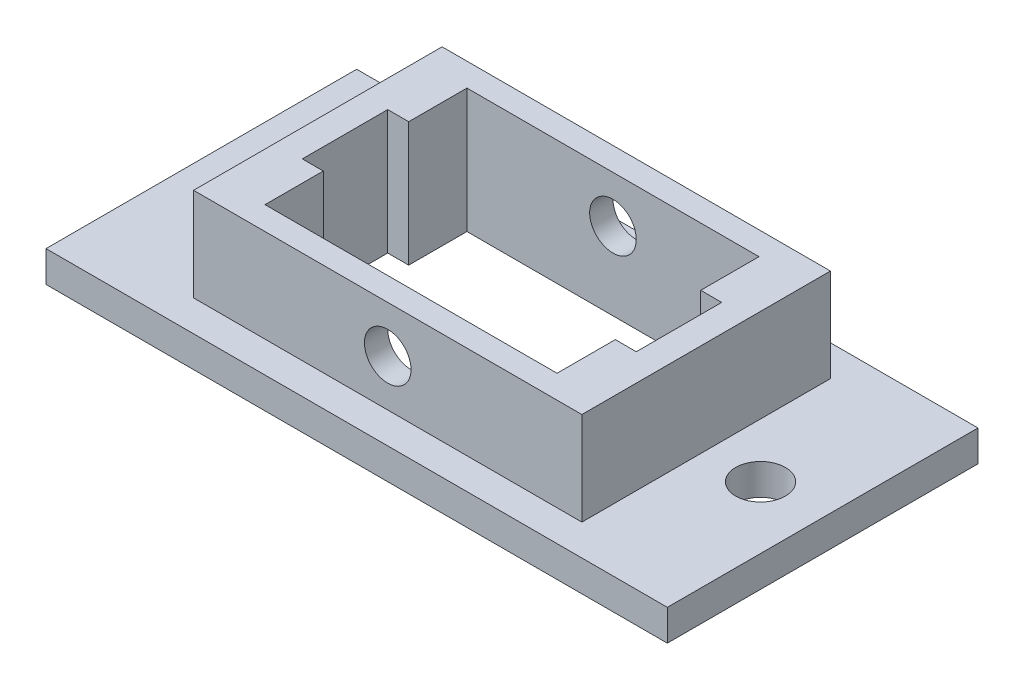
ISO-10303-21;
HEADER;
FILE_DESCRIPTION(('STEP AP214'),'2;1');
FILE_NAME('part.step','',(''),(''),'','','');
FILE_SCHEMA(('AUTOMOTIVE_DESIGN { 1 0 10303 214 1 1 1 1 }'));
ENDSEC;
DATA;
#1=APPLICATION_CONTEXT('core data for automotive mechanical design processes');
#2=APPLICATION_PROTOCOL_DEFINITION('international standard','automotive_design',2000,#1);
#3=PRODUCT_CONTEXT('',#1,'mechanical');
#4=PRODUCT('Part','Part','',(#3));
#5=PRODUCT_RELATED_PRODUCT_CATEGORY('part','',(#4));
#6=PRODUCT_DEFINITION_FORMATION('','',#4);
#7=PRODUCT_DEFINITION_CONTEXT('part definition',#1,'design');
#8=PRODUCT_DEFINITION('design','',#6,#7);
#9=PRODUCT_DEFINITION_SHAPE('','',#8);
#10=(LENGTH_UNIT() NAMED_UNIT(*) SI_UNIT(.MILLI.,.METRE.));
#11=(NAMED_UNIT(*) PLANE_ANGLE_UNIT() SI_UNIT($,.RADIAN.));
#12=(NAMED_UNIT(*) SI_UNIT($,.STERADIAN.) SOLID_ANGLE_UNIT());
#13=UNCERTAINTY_MEASURE_WITH_UNIT(LENGTH_MEASURE(1.E-05),#10,'distance_accuracy_value','');
#14=(GEOMETRIC_REPRESENTATION_CONTEXT(3) GLOBAL_UNCERTAINTY_ASSIGNED_CONTEXT((#13)) GLOBAL_UNIT_ASSIGNED_CONTEXT((#10,
#11,#12)) REPRESENTATION_CONTEXT('',''));
#15=CARTESIAN_POINT('',(0.,0.,0.));
#16=DIRECTION('',(0.,0.,1.));
#17=DIRECTION('',(1.,0.,0.));
#18=AXIS2_PLACEMENT_3D('',#15,#16,#17);
#19=CARTESIAN_POINT('',(0.,0.,0.));
#20=DIRECTION('',(0.,-1.,0.));
#21=DIRECTION('',(0.,0.,-1.));
#22=AXIS2_PLACEMENT_3D('',#19,#20,#21);
#23=PLANE('',#22);
#24=CARTESIAN_POINT('',(-13.6363636363636,0.,3.45454545454546));
#25=DIRECTION('',(0.,-1.,0.));
#26=DIRECTION('',(0.,0.,-1.));
#27=AXIS2_PLACEMENT_3D('',#24,#25,#26);
#28=CIRCLE('',#27,1.6);
#29=CARTESIAN_POINT('',(-13.6363636363636,0.,1.85454545454545));
#30=VERTEX_POINT('',#29);
#31=EDGE_CURVE('E330',#30,#30,#28,.T.);
#32=ORIENTED_EDGE('',*,*,#31,.F.);
#33=EDGE_LOOP('',(#32));
#34=FACE_BOUND('',#33,.T.);
#35=CARTESIAN_POINT('',(18.3636363636364,0.,3.45454545454546));
#36=DIRECTION('',(0.,-1.,0.));
#37=DIRECTION('',(0.,0.,-1.));
#38=AXIS2_PLACEMENT_3D('',#35,#36,#37);
#39=CIRCLE('',#38,1.6);
#40=CARTESIAN_POINT('',(18.3636363636364,0.,1.85454545454545));
#41=VERTEX_POINT('',#40);
#42=EDGE_CURVE('E194',#41,#41,#39,.T.);
#43=ORIENTED_EDGE('',*,*,#42,.F.);
#44=EDGE_LOOP('',(#43));
#45=FACE_BOUND('',#44,.T.);
#46=DIRECTION('',(0.,0.,1.));
#47=VECTOR('',#46,1.);
#48=CARTESIAN_POINT('',(-17.6363636363636,0.,13.4545454545455));
#49=LINE('',#48,#47);
#50=CARTESIAN_POINT('',(-17.6363636363636,0.,-6.54545454545454));
#51=VERTEX_POINT('',#50);
#52=CARTESIAN_POINT('',(-17.6363636363636,0.,13.4545454545455));
#53=VERTEX_POINT('',#52);
#54=EDGE_CURVE('E278',#51,#53,#49,.T.);
#55=ORIENTED_EDGE('',*,*,#54,.F.);
#56=DIRECTION('',(-1.,0.,0.));
#57=VECTOR('',#56,1.);
#58=CARTESIAN_POINT('',(-17.6363636363636,0.,-6.54545454545454));
#59=LINE('',#58,#57);
#60=CARTESIAN_POINT('',(22.3636363636364,0.,-6.54545454545454));
#61=VERTEX_POINT('',#60);
#62=EDGE_CURVE('E283',#61,#51,#59,.T.);
#63=ORIENTED_EDGE('',*,*,#62,.F.);
#64=DIRECTION('',(0.,0.,-1.));
#65=VECTOR('',#64,1.);
#66=CARTESIAN_POINT('',(22.3636363636364,0.,13.4545454545455));
#67=LINE('',#66,#65);
#68=CARTESIAN_POINT('',(22.3636363636364,0.,13.4545454545455));
#69=VERTEX_POINT('',#68);
#70=EDGE_CURVE('E294',#69,#61,#67,.T.);
#71=ORIENTED_EDGE('',*,*,#70,.F.);
#72=DIRECTION('',(1.,0.,0.));
#73=VECTOR('',#72,1.);
#74=CARTESIAN_POINT('',(-17.6363636363636,0.,13.4545454545455));
#75=LINE('',#74,#73);
#76=EDGE_CURVE('E292',#53,#69,#75,.T.);
#77=ORIENTED_EDGE('',*,*,#76,.F.);
#78=EDGE_LOOP('',(#55,#63,#71,#77));
#79=FACE_BOUND('',#78,.T.);
#80=DIRECTION('',(-1.,0.,0.));
#81=VECTOR('',#80,1.);
#82=CARTESIAN_POINT('',(-7.03636363636364,0.,-3.04545454545454));
#83=LINE('',#82,#81);
#84=CARTESIAN_POINT('',(11.7636363636364,0.,-3.04545454545454));
#85=VERTEX_POINT('',#84);
#86=CARTESIAN_POINT('',(-7.03636363636364,0.,-3.04545454545454));
#87=VERTEX_POINT('',#86);
#88=EDGE_CURVE('E190',#85,#87,#83,.T.);
#89=ORIENTED_EDGE('',*,*,#88,.T.);
#90=DIRECTION('',(0.,0.,1.));
#91=VECTOR('',#90,1.);
#92=CARTESIAN_POINT('',(-7.03636363636364,0.,-3.04545454545454));
#93=LINE('',#92,#91);
#94=CARTESIAN_POINT('',(-7.03636363636364,0.,0.704545454545459));
#95=VERTEX_POINT('',#94);
#96=EDGE_CURVE('E50',#87,#95,#93,.T.);
#97=ORIENTED_EDGE('',*,*,#96,.T.);
#98=DIRECTION('',(-1.,0.,0.));
#99=VECTOR('',#98,1.);
#100=CARTESIAN_POINT('',(-8.38636363636364,0.,0.704545454545459));
#101=LINE('',#100,#99);
#102=CARTESIAN_POINT('',(-8.38636363636364,0.,0.704545454545459));
#103=VERTEX_POINT('',#102);
#104=EDGE_CURVE('E180',#95,#103,#101,.T.);
#105=ORIENTED_EDGE('',*,*,#104,.T.);
#106=DIRECTION('',(0.,0.,1.));
#107=VECTOR('',#106,1.);
#108=CARTESIAN_POINT('',(-8.38636363636364,0.,0.704545454545459));
#109=LINE('',#108,#107);
#110=CARTESIAN_POINT('',(-8.38636363636364,0.,6.20454545454546));
#111=VERTEX_POINT('',#110);
#112=EDGE_CURVE('E186',#103,#111,#109,.T.);
#113=ORIENTED_EDGE('',*,*,#112,.T.);
#114=DIRECTION('',(1.,0.,0.));
#115=VECTOR('',#114,1.);
#116=CARTESIAN_POINT('',(-8.38636363636364,0.,6.20454545454546));
#117=LINE('',#116,#115);
#118=CARTESIAN_POINT('',(-7.03636363636364,0.,6.20454545454546));
#119=VERTEX_POINT('',#118);
#120=EDGE_CURVE('E200',#111,#119,#117,.T.);
#121=ORIENTED_EDGE('',*,*,#120,.T.);
#122=DIRECTION('',(0.,0.,1.));
#123=VECTOR('',#122,1.);
#124=CARTESIAN_POINT('',(-7.03636363636364,0.,6.20454545454546));
#125=LINE('',#124,#123);
#126=CARTESIAN_POINT('',(-7.03636363636364,0.,9.95454545454546));
#127=VERTEX_POINT('',#126);
#128=EDGE_CURVE('E203',#119,#127,#125,.T.);
#129=ORIENTED_EDGE('',*,*,#128,.T.);
#130=DIRECTION('',(1.,0.,0.));
#131=VECTOR('',#130,1.);
#132=CARTESIAN_POINT('',(-7.03636363636364,0.,9.95454545454546));
#133=LINE('',#132,#131);
#134=CARTESIAN_POINT('',(11.7636363636364,0.,9.95454545454546));
#135=VERTEX_POINT('',#134);
#136=EDGE_CURVE('E206',#127,#135,#133,.T.);
#137=ORIENTED_EDGE('',*,*,#136,.T.);
#138=DIRECTION('',(0.,0.,-1.));
#139=VECTOR('',#138,1.);
#140=CARTESIAN_POINT('',(11.7636363636364,0.,6.20454545454546));
#141=LINE('',#140,#139);
#142=CARTESIAN_POINT('',(11.7636363636364,0.,6.20454545454546));
#143=VERTEX_POINT('',#142);
#144=EDGE_CURVE('E209',#135,#143,#141,.T.);
#145=ORIENTED_EDGE('',*,*,#144,.T.);
#146=DIRECTION('',(1.,0.,0.));
#147=VECTOR('',#146,1.);
#148=CARTESIAN_POINT('',(11.7636363636364,0.,6.20454545454546));
#149=LINE('',#148,#147);
#150=CARTESIAN_POINT('',(13.1136363636364,0.,6.20454545454546));
#151=VERTEX_POINT('',#150);
#152=EDGE_CURVE('E212',#143,#151,#149,.T.);
#153=ORIENTED_EDGE('',*,*,#152,.T.);
#154=DIRECTION('',(0.,0.,-1.));
#155=VECTOR('',#154,1.);
#156=CARTESIAN_POINT('',(13.1136363636364,0.,0.704545454545456));
#157=LINE('',#156,#155);
#158=CARTESIAN_POINT('',(13.1136363636364,0.,0.704545454545456));
#159=VERTEX_POINT('',#158);
#160=EDGE_CURVE('E215',#151,#159,#157,.T.);
#161=ORIENTED_EDGE('',*,*,#160,.T.);
#162=DIRECTION('',(-1.,0.,0.));
#163=VECTOR('',#162,1.);
#164=CARTESIAN_POINT('',(11.7636363636364,0.,0.704545454545457));
#165=LINE('',#164,#163);
#166=CARTESIAN_POINT('',(11.7636363636364,0.,0.704545454545457));
#167=VERTEX_POINT('',#166);
#168=EDGE_CURVE('E218',#159,#167,#165,.T.);
#169=ORIENTED_EDGE('',*,*,#168,.T.);
#170=DIRECTION('',(0.,0.,-1.));
#171=VECTOR('',#170,1.);
#172=CARTESIAN_POINT('',(11.7636363636364,0.,-3.04545454545454));
#173=LINE('',#172,#171);
#174=EDGE_CURVE('E221',#167,#85,#173,.T.);
#175=ORIENTED_EDGE('',*,*,#174,.T.);
#176=EDGE_LOOP('',(#89,#97,#105,#113,#121,#129,#137,#145,#153,#161,#169,#175));
#177=FACE_BOUND('',#176,.T.);
#178=ADVANCED_FACE('F33',(#34,#45,#79,#177),#23,.T.);
#179=CARTESIAN_POINT('',(0.,8.,0.));
#180=DIRECTION('',(0.,-1.,0.));
#181=DIRECTION('',(0.,0.,-1.));
#182=AXIS2_PLACEMENT_3D('',#179,#180,#181);
#183=PLANE('',#182);
#184=DIRECTION('',(0.,0.,-1.));
#185=VECTOR('',#184,1.);
#186=CARTESIAN_POINT('',(-10.1363636363636,8.,11.4545454545455));
#187=LINE('',#186,#185);
#188=CARTESIAN_POINT('',(-10.1363636363636,8.,11.4545454545455));
#189=VERTEX_POINT('',#188);
#190=CARTESIAN_POINT('',(-10.1363636363636,8.,-4.54545454545454));
#191=VERTEX_POINT('',#190);
#192=EDGE_CURVE('E176',#189,#191,#187,.T.);
#193=ORIENTED_EDGE('',*,*,#192,.F.);
#194=DIRECTION('',(-1.,0.,0.));
#195=VECTOR('',#194,1.);
#196=CARTESIAN_POINT('',(-10.1363636363636,8.,11.4545454545455));
#197=LINE('',#196,#195);
#198=CARTESIAN_POINT('',(14.8636363636364,8.,11.4545454545455));
#199=VERTEX_POINT('',#198);
#200=EDGE_CURVE('E252',#199,#189,#197,.T.);
#201=ORIENTED_EDGE('',*,*,#200,.F.);
#202=DIRECTION('',(0.,0.,1.));
#203=VECTOR('',#202,1.);
#204=CARTESIAN_POINT('',(14.8636363636364,8.,11.4545454545455));
#205=LINE('',#204,#203);
#206=CARTESIAN_POINT('',(14.8636363636364,8.,-4.54545454545454));
#207=VERTEX_POINT('',#206);
#208=EDGE_CURVE('E249',#207,#199,#205,.T.);
#209=ORIENTED_EDGE('',*,*,#208,.F.);
#210=DIRECTION('',(1.,0.,0.));
#211=VECTOR('',#210,1.);
#212=CARTESIAN_POINT('',(-10.1363636363636,8.,-4.54545454545454));
#213=LINE('',#212,#211);
#214=EDGE_CURVE('E246',#191,#207,#213,.T.);
#215=ORIENTED_EDGE('',*,*,#214,.F.);
#216=EDGE_LOOP('',(#193,#201,#209,#215));
#217=FACE_BOUND('',#216,.T.);
#218=DIRECTION('',(0.,0.,1.));
#219=VECTOR('',#218,1.);
#220=CARTESIAN_POINT('',(-7.03636363636364,8.,0.));
#221=LINE('',#220,#219);
#222=CARTESIAN_POINT('',(-7.03636363636364,8.,-3.04545454545454));
#223=VERTEX_POINT('',#222);
#224=CARTESIAN_POINT('',(-7.03636363636364,8.,0.704545454545459));
#225=VERTEX_POINT('',#224);
#226=EDGE_CURVE('E11',#223,#225,#221,.T.);
#227=ORIENTED_EDGE('',*,*,#226,.F.);
#228=DIRECTION('',(-1.,0.,0.));
#229=VECTOR('',#228,1.);
#230=CARTESIAN_POINT('',(0.,8.,-3.04545454545454));
#231=LINE('',#230,#229);
#232=CARTESIAN_POINT('',(11.7636363636364,8.,-3.04545454545454));
#233=VERTEX_POINT('',#232);
#234=EDGE_CURVE('E308',#233,#223,#231,.T.);
#235=ORIENTED_EDGE('',*,*,#234,.F.);
#236=DIRECTION('',(0.,0.,-1.));
#237=VECTOR('',#236,1.);
#238=CARTESIAN_POINT('',(11.7636363636364,8.,0.));
#239=LINE('',#238,#237);
#240=CARTESIAN_POINT('',(11.7636363636364,8.,0.704545454545457));
#241=VERTEX_POINT('',#240);
#242=EDGE_CURVE('E310',#241,#233,#239,.T.);
#243=ORIENTED_EDGE('',*,*,#242,.F.);
#244=DIRECTION('',(-1.,0.,0.));
#245=VECTOR('',#244,1.);
#246=CARTESIAN_POINT('',(0.,8.,0.70454545454546));
#247=LINE('',#246,#245);
#248=CARTESIAN_POINT('',(13.1136363636364,8.,0.704545454545456));
#249=VERTEX_POINT('',#248);
#250=EDGE_CURVE('E312',#249,#241,#247,.T.);
#251=ORIENTED_EDGE('',*,*,#250,.F.);
#252=DIRECTION('',(0.,0.,-1.));
#253=VECTOR('',#252,1.);
#254=CARTESIAN_POINT('',(13.1136363636364,8.,0.));
#255=LINE('',#254,#253);
#256=CARTESIAN_POINT('',(13.1136363636364,8.,6.20454545454546));
#257=VERTEX_POINT('',#256);
#258=EDGE_CURVE('E314',#257,#249,#255,.T.);
#259=ORIENTED_EDGE('',*,*,#258,.F.);
#260=DIRECTION('',(1.,0.,0.));
#261=VECTOR('',#260,1.);
#262=CARTESIAN_POINT('',(0.,8.,6.20454545454546));
#263=LINE('',#262,#261);
#264=CARTESIAN_POINT('',(11.7636363636364,8.,6.20454545454546));
#265=VERTEX_POINT('',#264);
#266=EDGE_CURVE('E316',#265,#257,#263,.T.);
#267=ORIENTED_EDGE('',*,*,#266,.F.);
#268=DIRECTION('',(0.,0.,-1.));
#269=VECTOR('',#268,1.);
#270=CARTESIAN_POINT('',(11.7636363636364,8.,0.));
#271=LINE('',#270,#269);
#272=CARTESIAN_POINT('',(11.7636363636364,8.,9.95454545454546));
#273=VERTEX_POINT('',#272);
#274=EDGE_CURVE('E318',#273,#265,#271,.T.);
#275=ORIENTED_EDGE('',*,*,#274,.F.);
#276=DIRECTION('',(1.,0.,0.));
#277=VECTOR('',#276,1.);
#278=CARTESIAN_POINT('',(0.,8.,9.95454545454546));
#279=LINE('',#278,#277);
#280=CARTESIAN_POINT('',(-7.03636363636364,8.,9.95454545454546));
#281=VERTEX_POINT('',#280);
#282=EDGE_CURVE('E320',#281,#273,#279,.T.);
#283=ORIENTED_EDGE('',*,*,#282,.F.);
#284=DIRECTION('',(0.,0.,1.));
#285=VECTOR('',#284,1.);
#286=CARTESIAN_POINT('',(-7.03636363636364,8.,0.));
#287=LINE('',#286,#285);
#288=CARTESIAN_POINT('',(-7.03636363636364,8.,6.20454545454546));
#289=VERTEX_POINT('',#288);
#290=EDGE_CURVE('E322',#289,#281,#287,.T.);
#291=ORIENTED_EDGE('',*,*,#290,.F.);
#292=DIRECTION('',(1.,0.,0.));
#293=VECTOR('',#292,1.);
#294=CARTESIAN_POINT('',(0.,8.,6.20454545454546));
#295=LINE('',#294,#293);
#296=CARTESIAN_POINT('',(-8.38636363636364,8.,6.20454545454546));
#297=VERTEX_POINT('',#296);
#298=EDGE_CURVE('E324',#297,#289,#295,.T.);
#299=ORIENTED_EDGE('',*,*,#298,.F.);
#300=DIRECTION('',(0.,0.,1.));
#301=VECTOR('',#300,1.);
#302=CARTESIAN_POINT('',(-8.38636363636364,8.,0.));
#303=LINE('',#302,#301);
#304=CARTESIAN_POINT('',(-8.38636363636364,8.,0.704545454545459));
#305=VERTEX_POINT('',#304);
#306=EDGE_CURVE('E326',#305,#297,#303,.T.);
#307=ORIENTED_EDGE('',*,*,#306,.F.);
#308=DIRECTION('',(-1.,0.,0.));
#309=VECTOR('',#308,1.);
#310=CARTESIAN_POINT('',(0.,8.,0.704545454545456));
#311=LINE('',#310,#309);
#312=EDGE_CURVE('E42',#225,#305,#311,.T.);
#313=ORIENTED_EDGE('',*,*,#312,.F.);
#314=EDGE_LOOP('',(#227,#235,#243,#251,#259,#267,#275,#283,#291,#299,#307,#313));
#315=FACE_BOUND('',#314,.T.);
#316=ADVANCED_FACE('F361',(#217,#315),#183,.F.);
#317=CARTESIAN_POINT('',(-17.6363636363636,2.,13.4545454545455));
#318=DIRECTION('',(1.,0.,0.));
#319=DIRECTION('',(0.,0.,-1.));
#320=AXIS2_PLACEMENT_3D('',#317,#318,#319);
#321=PLANE('',#320);
#322=ORIENTED_EDGE('',*,*,#54,.T.);
#323=DIRECTION('',(0.,-1.,0.));
#324=VECTOR('',#323,1.);
#325=CARTESIAN_POINT('',(-17.6363636363636,2.,13.4545454545455));
#326=LINE('',#325,#324);
#327=CARTESIAN_POINT('',(-17.6363636363636,2.,13.4545454545455));
#328=VERTEX_POINT('',#327);
#329=EDGE_CURVE('E305',#328,#53,#326,.T.);
#330=ORIENTED_EDGE('',*,*,#329,.F.);
#331=DIRECTION('',(0.,0.,1.));
#332=VECTOR('',#331,1.);
#333=CARTESIAN_POINT('',(-17.6363636363636,2.,13.4545454545455));
#334=LINE('',#333,#332);
#335=CARTESIAN_POINT('',(-17.6363636363636,2.,-6.54545454545454));
#336=VERTEX_POINT('',#335);
#337=EDGE_CURVE('E279',#336,#328,#334,.T.);
#338=ORIENTED_EDGE('',*,*,#337,.F.);
#339=DIRECTION('',(0.,-1.,0.));
#340=VECTOR('',#339,1.);
#341=CARTESIAN_POINT('',(-17.6363636363636,2.,-6.54545454545454));
#342=LINE('',#341,#340);
#343=EDGE_CURVE('E289',#336,#51,#342,.T.);
#344=ORIENTED_EDGE('',*,*,#343,.T.);
#345=EDGE_LOOP('',(#322,#330,#338,#344));
#346=FACE_BOUND('',#345,.T.);
#347=ADVANCED_FACE('F35',(#346),#321,.F.);
#348=CARTESIAN_POINT('',(-17.6363636363636,2.,13.4545454545455));
#349=DIRECTION('',(0.,0.,-1.));
#350=DIRECTION('',(-1.,0.,0.));
#351=AXIS2_PLACEMENT_3D('',#348,#349,#350);
#352=PLANE('',#351);
#353=ORIENTED_EDGE('',*,*,#76,.T.);
#354=DIRECTION('',(0.,-1.,0.));
#355=VECTOR('',#354,1.);
#356=CARTESIAN_POINT('',(22.3636363636364,2.,13.4545454545455));
#357=LINE('',#356,#355);
#358=CARTESIAN_POINT('',(22.3636363636364,2.,13.4545454545455));
#359=VERTEX_POINT('',#358);
#360=EDGE_CURVE('E302',#359,#69,#357,.T.);
#361=ORIENTED_EDGE('',*,*,#360,.F.);
#362=DIRECTION('',(1.,0.,0.));
#363=VECTOR('',#362,1.);
#364=CARTESIAN_POINT('',(-17.6363636363636,2.,13.4545454545455));
#365=LINE('',#364,#363);
#366=EDGE_CURVE('E282',#328,#359,#365,.T.);
#367=ORIENTED_EDGE('',*,*,#366,.F.);
#368=ORIENTED_EDGE('',*,*,#329,.T.);
#369=EDGE_LOOP('',(#353,#361,#367,#368));
#370=FACE_BOUND('',#369,.T.);
#371=ADVANCED_FACE('F429',(#370),#352,.F.);
#372=CARTESIAN_POINT('',(22.3636363636364,2.,13.4545454545455));
#373=DIRECTION('',(-1.,0.,0.));
#374=DIRECTION('',(0.,0.,1.));
#375=AXIS2_PLACEMENT_3D('',#372,#373,#374);
#376=PLANE('',#375);
#377=ORIENTED_EDGE('',*,*,#70,.T.);
#378=DIRECTION('',(0.,-1.,0.));
#379=VECTOR('',#378,1.);
#380=CARTESIAN_POINT('',(22.3636363636364,2.,-6.54545454545454));
#381=LINE('',#380,#379);
#382=CARTESIAN_POINT('',(22.3636363636364,2.,-6.54545454545454));
#383=VERTEX_POINT('',#382);
#384=EDGE_CURVE('E299',#383,#61,#381,.T.);
#385=ORIENTED_EDGE('',*,*,#384,.F.);
#386=DIRECTION('',(0.,0.,-1.));
#387=VECTOR('',#386,1.);
#388=CARTESIAN_POINT('',(22.3636363636364,2.,13.4545454545455));
#389=LINE('',#388,#387);
#390=EDGE_CURVE('E285',#359,#383,#389,.T.);
#391=ORIENTED_EDGE('',*,*,#390,.F.);
#392=ORIENTED_EDGE('',*,*,#360,.T.);
#393=EDGE_LOOP('',(#377,#385,#391,#392));
#394=FACE_BOUND('',#393,.T.);
#395=ADVANCED_FACE('F426',(#394),#376,.F.);
#396=CARTESIAN_POINT('',(-17.6363636363636,2.,-6.54545454545454));
#397=DIRECTION('',(0.,0.,1.));
#398=DIRECTION('',(1.,0.,0.));
#399=AXIS2_PLACEMENT_3D('',#396,#397,#398);
#400=PLANE('',#399);
#401=ORIENTED_EDGE('',*,*,#62,.T.);
#402=ORIENTED_EDGE('',*,*,#343,.F.);
#403=DIRECTION('',(-1.,0.,0.));
#404=VECTOR('',#403,1.);
#405=CARTESIAN_POINT('',(-17.6363636363636,2.,-6.54545454545454));
#406=LINE('',#405,#404);
#407=EDGE_CURVE('E287',#383,#336,#406,.T.);
#408=ORIENTED_EDGE('',*,*,#407,.F.);
#409=ORIENTED_EDGE('',*,*,#384,.T.);
#410=EDGE_LOOP('',(#401,#402,#408,#409));
#411=FACE_BOUND('',#410,.T.);
#412=ADVANCED_FACE('F423',(#411),#400,.F.);
#413=CARTESIAN_POINT('',(0.,2.,0.));
#414=DIRECTION('',(0.,-1.,0.));
#415=DIRECTION('',(0.,0.,-1.));
#416=AXIS2_PLACEMENT_3D('',#413,#414,#415);
#417=PLANE('',#416);
#418=CARTESIAN_POINT('',(-13.6363636363636,2.,3.45454545454546));
#419=DIRECTION('',(0.,-1.,0.));
#420=DIRECTION('',(0.,0.,-1.));
#421=AXIS2_PLACEMENT_3D('',#418,#419,#420);
#422=CIRCLE('',#421,1.6);
#423=CARTESIAN_POINT('',(-13.6363636363636,2.,1.85454545454545));
#424=VERTEX_POINT('',#423);
#425=EDGE_CURVE('E328',#424,#424,#422,.T.);
#426=ORIENTED_EDGE('',*,*,#425,.T.);
#427=EDGE_LOOP('',(#426));
#428=FACE_BOUND('',#427,.T.);
#429=CARTESIAN_POINT('',(18.3636363636364,2.,3.45454545454546));
#430=DIRECTION('',(0.,-1.,0.));
#431=DIRECTION('',(0.,0.,-1.));
#432=AXIS2_PLACEMENT_3D('',#429,#430,#431);
#433=CIRCLE('',#432,1.6);
#434=CARTESIAN_POINT('',(18.3636363636364,2.,1.85454545454545));
#435=VERTEX_POINT('',#434);
#436=EDGE_CURVE('E191',#435,#435,#433,.T.);
#437=ORIENTED_EDGE('',*,*,#436,.T.);
#438=EDGE_LOOP('',(#437));
#439=FACE_BOUND('',#438,.T.);
#440=DIRECTION('',(-1.,0.,0.));
#441=VECTOR('',#440,1.);
#442=CARTESIAN_POINT('',(0.,2.,11.4545454545455));
#443=LINE('',#442,#441);
#444=CARTESIAN_POINT('',(14.8636363636364,2.,11.4545454545455));
#445=VERTEX_POINT('',#444);
#446=CARTESIAN_POINT('',(-10.1363636363636,2.,11.4545454545455));
#447=VERTEX_POINT('',#446);
#448=EDGE_CURVE('E272',#445,#447,#443,.T.);
#449=ORIENTED_EDGE('',*,*,#448,.T.);
#450=DIRECTION('',(0.,0.,-1.));
#451=VECTOR('',#450,1.);
#452=CARTESIAN_POINT('',(-10.1363636363636,2.,0.));
#453=LINE('',#452,#451);
#454=CARTESIAN_POINT('',(-10.1363636363636,2.,-4.54545454545454));
#455=VERTEX_POINT('',#454);
#456=EDGE_CURVE('E275',#447,#455,#453,.T.);
#457=ORIENTED_EDGE('',*,*,#456,.T.);
#458=DIRECTION('',(1.,0.,0.));
#459=VECTOR('',#458,1.);
#460=CARTESIAN_POINT('',(0.,2.,-4.54545454545454));
#461=LINE('',#460,#459);
#462=CARTESIAN_POINT('',(14.8636363636364,2.,-4.54545454545454));
#463=VERTEX_POINT('',#462);
#464=EDGE_CURVE('E259',#455,#463,#461,.T.);
#465=ORIENTED_EDGE('',*,*,#464,.T.);
#466=DIRECTION('',(0.,0.,1.));
#467=VECTOR('',#466,1.);
#468=CARTESIAN_POINT('',(14.8636363636364,2.,0.));
#469=LINE('',#468,#467);
#470=EDGE_CURVE('E269',#463,#445,#469,.T.);
#471=ORIENTED_EDGE('',*,*,#470,.T.);
#472=EDGE_LOOP('',(#449,#457,#465,#471));
#473=FACE_BOUND('',#472,.T.);
#474=ORIENTED_EDGE('',*,*,#337,.T.);
#475=ORIENTED_EDGE('',*,*,#366,.T.);
#476=ORIENTED_EDGE('',*,*,#390,.T.);
#477=ORIENTED_EDGE('',*,*,#407,.T.);
#478=EDGE_LOOP('',(#474,#475,#476,#477));
#479=FACE_BOUND('',#478,.T.);
#480=ADVANCED_FACE('F421',(#428,#439,#473,#479),#417,.F.);
#481=CARTESIAN_POINT('',(-10.1363636363636,8.,11.4545454545455));
#482=DIRECTION('',(-1.,0.,0.));
#483=DIRECTION('',(0.,0.,1.));
#484=AXIS2_PLACEMENT_3D('',#481,#482,#483);
#485=PLANE('',#484);
#486=ORIENTED_EDGE('',*,*,#456,.F.);
#487=DIRECTION('',(0.,-1.,0.));
#488=VECTOR('',#487,1.);
#489=CARTESIAN_POINT('',(-10.1363636363636,8.,11.4545454545455));
#490=LINE('',#489,#488);
#491=EDGE_CURVE('E256',#189,#447,#490,.T.);
#492=ORIENTED_EDGE('',*,*,#491,.F.);
#493=ORIENTED_EDGE('',*,*,#192,.T.);
#494=DIRECTION('',(0.,-1.,0.));
#495=VECTOR('',#494,1.);
#496=CARTESIAN_POINT('',(-10.1363636363636,8.,-4.54545454545454));
#497=LINE('',#496,#495);
#498=EDGE_CURVE('E255',#191,#455,#497,.T.);
#499=ORIENTED_EDGE('',*,*,#498,.T.);
#500=EDGE_LOOP('',(#486,#492,#493,#499));
#501=FACE_BOUND('',#500,.T.);
#502=ADVANCED_FACE('F450',(#501),#485,.T.);
#503=CARTESIAN_POINT('',(-10.1363636363636,8.,11.4545454545455));
#504=DIRECTION('',(0.,0.,1.));
#505=DIRECTION('',(1.,0.,0.));
#506=AXIS2_PLACEMENT_3D('',#503,#504,#505);
#507=PLANE('',#506);
#508=CARTESIAN_POINT('',(2.36363636363636,5.,11.4545454545455));
#509=DIRECTION('',(0.,0.,1.));
#510=DIRECTION('',(1.,0.,0.));
#511=AXIS2_PLACEMENT_3D('',#508,#509,#510);
#512=CIRCLE('',#511,1.5);
#513=CARTESIAN_POINT('',(3.86363636363636,5.,11.4545454545455));
#514=VERTEX_POINT('',#513);
#515=EDGE_CURVE('E344',#514,#514,#512,.T.);
#516=ORIENTED_EDGE('',*,*,#515,.F.);
#517=EDGE_LOOP('',(#516));
#518=FACE_BOUND('',#517,.T.);
#519=ORIENTED_EDGE('',*,*,#448,.F.);
#520=DIRECTION('',(0.,-1.,0.));
#521=VECTOR('',#520,1.);
#522=CARTESIAN_POINT('',(14.8636363636364,8.,11.4545454545455));
#523=LINE('',#522,#521);
#524=EDGE_CURVE('E260',#199,#445,#523,.T.);
#525=ORIENTED_EDGE('',*,*,#524,.F.);
#526=ORIENTED_EDGE('',*,*,#200,.T.);
#527=ORIENTED_EDGE('',*,*,#491,.T.);
#528=EDGE_LOOP('',(#519,#525,#526,#527));
#529=FACE_BOUND('',#528,.T.);
#530=ADVANCED_FACE('F454',(#518,#529),#507,.T.);
#531=CARTESIAN_POINT('',(14.8636363636364,8.,11.4545454545455));
#532=DIRECTION('',(1.,0.,0.));
#533=DIRECTION('',(0.,0.,-1.));
#534=AXIS2_PLACEMENT_3D('',#531,#532,#533);
#535=PLANE('',#534);
#536=ORIENTED_EDGE('',*,*,#470,.F.);
#537=DIRECTION('',(0.,-1.,0.));
#538=VECTOR('',#537,1.);
#539=CARTESIAN_POINT('',(14.8636363636364,8.,-4.54545454545454));
#540=LINE('',#539,#538);
#541=EDGE_CURVE('E263',#207,#463,#540,.T.);
#542=ORIENTED_EDGE('',*,*,#541,.F.);
#543=ORIENTED_EDGE('',*,*,#208,.T.);
#544=ORIENTED_EDGE('',*,*,#524,.T.);
#545=EDGE_LOOP('',(#536,#542,#543,#544));
#546=FACE_BOUND('',#545,.T.);
#547=ADVANCED_FACE('F462',(#546),#535,.T.);
#548=CARTESIAN_POINT('',(-10.1363636363636,8.,-4.54545454545454));
#549=DIRECTION('',(0.,0.,-1.));
#550=DIRECTION('',(-1.,0.,0.));
#551=AXIS2_PLACEMENT_3D('',#548,#549,#550);
#552=PLANE('',#551);
#553=CARTESIAN_POINT('',(2.36363636363636,5.,-4.54545454545454));
#554=DIRECTION('',(0.,0.,-1.));
#555=DIRECTION('',(-1.,0.,0.));
#556=AXIS2_PLACEMENT_3D('',#553,#554,#555);
#557=CIRCLE('',#556,1.5);
#558=CARTESIAN_POINT('',(0.863636363636356,5.,-4.54545454545454));
#559=VERTEX_POINT('',#558);
#560=EDGE_CURVE('E335',#559,#559,#557,.T.);
#561=ORIENTED_EDGE('',*,*,#560,.F.);
#562=EDGE_LOOP('',(#561));
#563=FACE_BOUND('',#562,.T.);
#564=ORIENTED_EDGE('',*,*,#464,.F.);
#565=ORIENTED_EDGE('',*,*,#498,.F.);
#566=ORIENTED_EDGE('',*,*,#214,.T.);
#567=ORIENTED_EDGE('',*,*,#541,.T.);
#568=EDGE_LOOP('',(#564,#565,#566,#567));
#569=FACE_BOUND('',#568,.T.);
#570=ADVANCED_FACE('F468',(#563,#569),#552,.T.);
#571=CARTESIAN_POINT('',(-7.03636363636364,10.,-3.04545454545454));
#572=DIRECTION('',(1.,0.,0.));
#573=DIRECTION('',(0.,0.,-1.));
#574=AXIS2_PLACEMENT_3D('',#571,#572,#573);
#575=PLANE('',#574);
#576=ORIENTED_EDGE('',*,*,#226,.T.);
#577=DIRECTION('',(0.,-1.,0.));
#578=VECTOR('',#577,1.);
#579=CARTESIAN_POINT('',(-7.03636363636364,10.,0.704545454545459));
#580=LINE('',#579,#578);
#581=EDGE_CURVE('E170',#225,#95,#580,.T.);
#582=ORIENTED_EDGE('',*,*,#581,.T.);
#583=ORIENTED_EDGE('',*,*,#96,.F.);
#584=DIRECTION('',(0.,-1.,0.));
#585=VECTOR('',#584,1.);
#586=CARTESIAN_POINT('',(-7.03636363636364,10.,-3.04545454545454));
#587=LINE('',#586,#585);
#588=EDGE_CURVE('E224',#223,#87,#587,.T.);
#589=ORIENTED_EDGE('',*,*,#588,.F.);
#590=EDGE_LOOP('',(#576,#582,#583,#589));
#591=FACE_BOUND('',#590,.T.);
#592=ADVANCED_FACE('F172',(#591),#575,.T.);
#593=CARTESIAN_POINT('',(-8.38636363636364,10.,0.704545454545459));
#594=DIRECTION('',(0.,0.,1.));
#595=DIRECTION('',(1.,0.,0.));
#596=AXIS2_PLACEMENT_3D('',#593,#594,#595);
#597=PLANE('',#596);
#598=ORIENTED_EDGE('',*,*,#312,.T.);
#599=DIRECTION('',(0.,-1.,0.));
#600=VECTOR('',#599,1.);
#601=CARTESIAN_POINT('',(-8.38636363636364,10.,0.704545454545459));
#602=LINE('',#601,#600);
#603=EDGE_CURVE('E177',#305,#103,#602,.T.);
#604=ORIENTED_EDGE('',*,*,#603,.T.);
#605=ORIENTED_EDGE('',*,*,#104,.F.);
#606=ORIENTED_EDGE('',*,*,#581,.F.);
#607=EDGE_LOOP('',(#598,#604,#605,#606));
#608=FACE_BOUND('',#607,.T.);
#609=ADVANCED_FACE('F181',(#608),#597,.T.);
#610=CARTESIAN_POINT('',(-8.38636363636364,10.,0.704545454545459));
#611=DIRECTION('',(1.,0.,0.));
#612=DIRECTION('',(0.,0.,-1.));
#613=AXIS2_PLACEMENT_3D('',#610,#611,#612);
#614=PLANE('',#613);
#615=ORIENTED_EDGE('',*,*,#306,.T.);
#616=DIRECTION('',(0.,-1.,0.));
#617=VECTOR('',#616,1.);
#618=CARTESIAN_POINT('',(-8.38636363636364,10.,6.20454545454546));
#619=LINE('',#618,#617);
#620=EDGE_CURVE('E241',#297,#111,#619,.T.);
#621=ORIENTED_EDGE('',*,*,#620,.T.);
#622=ORIENTED_EDGE('',*,*,#112,.F.);
#623=ORIENTED_EDGE('',*,*,#603,.F.);
#624=EDGE_LOOP('',(#615,#621,#622,#623));
#625=FACE_BOUND('',#624,.T.);
#626=ADVANCED_FACE('F365',(#625),#614,.T.);
#627=CARTESIAN_POINT('',(-8.38636363636364,10.,6.20454545454546));
#628=DIRECTION('',(0.,0.,-1.));
#629=DIRECTION('',(-1.,0.,0.));
#630=AXIS2_PLACEMENT_3D('',#627,#628,#629);
#631=PLANE('',#630);
#632=ORIENTED_EDGE('',*,*,#298,.T.);
#633=DIRECTION('',(0.,-1.,0.));
#634=VECTOR('',#633,1.);
#635=CARTESIAN_POINT('',(-7.03636363636364,10.,6.20454545454546));
#636=LINE('',#635,#634);
#637=EDGE_CURVE('E239',#289,#119,#636,.T.);
#638=ORIENTED_EDGE('',*,*,#637,.T.);
#639=ORIENTED_EDGE('',*,*,#120,.F.);
#640=ORIENTED_EDGE('',*,*,#620,.F.);
#641=EDGE_LOOP('',(#632,#638,#639,#640));
#642=FACE_BOUND('',#641,.T.);
#643=ADVANCED_FACE('F370',(#642),#631,.T.);
#644=CARTESIAN_POINT('',(-7.03636363636364,10.,6.20454545454546));
#645=DIRECTION('',(1.,0.,0.));
#646=DIRECTION('',(0.,0.,-1.));
#647=AXIS2_PLACEMENT_3D('',#644,#645,#646);
#648=PLANE('',#647);
#649=ORIENTED_EDGE('',*,*,#290,.T.);
#650=DIRECTION('',(0.,-1.,0.));
#651=VECTOR('',#650,1.);
#652=CARTESIAN_POINT('',(-7.03636363636364,10.,9.95454545454546));
#653=LINE('',#652,#651);
#654=EDGE_CURVE('E237',#281,#127,#653,.T.);
#655=ORIENTED_EDGE('',*,*,#654,.T.);
#656=ORIENTED_EDGE('',*,*,#128,.F.);
#657=ORIENTED_EDGE('',*,*,#637,.F.);
#658=EDGE_LOOP('',(#649,#655,#656,#657));
#659=FACE_BOUND('',#658,.T.);
#660=ADVANCED_FACE('F374',(#659),#648,.T.);
#661=CARTESIAN_POINT('',(-7.03636363636364,10.,9.95454545454546));
#662=DIRECTION('',(0.,0.,-1.));
#663=DIRECTION('',(-1.,0.,0.));
#664=AXIS2_PLACEMENT_3D('',#661,#662,#663);
#665=PLANE('',#664);
#666=CARTESIAN_POINT('',(2.36363636363636,5.,9.95454545454546));
#667=DIRECTION('',(0.,0.,-1.));
#668=DIRECTION('',(-1.,0.,0.));
#669=AXIS2_PLACEMENT_3D('',#666,#667,#668);
#670=CIRCLE('',#669,1.5);
#671=CARTESIAN_POINT('',(0.863636363636356,5.,9.95454545454546));
#672=VERTEX_POINT('',#671);
#673=EDGE_CURVE('E339',#672,#672,#670,.T.);
#674=ORIENTED_EDGE('',*,*,#673,.F.);
#675=EDGE_LOOP('',(#674));
#676=FACE_BOUND('',#675,.T.);
#677=ORIENTED_EDGE('',*,*,#282,.T.);
#678=DIRECTION('',(0.,-1.,0.));
#679=VECTOR('',#678,1.);
#680=CARTESIAN_POINT('',(11.7636363636364,10.,9.95454545454546));
#681=LINE('',#680,#679);
#682=EDGE_CURVE('E235',#273,#135,#681,.T.);
#683=ORIENTED_EDGE('',*,*,#682,.T.);
#684=ORIENTED_EDGE('',*,*,#136,.F.);
#685=ORIENTED_EDGE('',*,*,#654,.F.);
#686=EDGE_LOOP('',(#677,#683,#684,#685));
#687=FACE_BOUND('',#686,.T.);
#688=ADVANCED_FACE('F379',(#676,#687),#665,.T.);
#689=CARTESIAN_POINT('',(11.7636363636364,10.,6.20454545454546));
#690=DIRECTION('',(-1.,0.,0.));
#691=DIRECTION('',(0.,0.,1.));
#692=AXIS2_PLACEMENT_3D('',#689,#690,#691);
#693=PLANE('',#692);
#694=ORIENTED_EDGE('',*,*,#274,.T.);
#695=DIRECTION('',(0.,-1.,0.));
#696=VECTOR('',#695,1.);
#697=CARTESIAN_POINT('',(11.7636363636364,10.,6.20454545454546));
#698=LINE('',#697,#696);
#699=EDGE_CURVE('E233',#265,#143,#698,.T.);
#700=ORIENTED_EDGE('',*,*,#699,.T.);
#701=ORIENTED_EDGE('',*,*,#144,.F.);
#702=ORIENTED_EDGE('',*,*,#682,.F.);
#703=EDGE_LOOP('',(#694,#700,#701,#702));
#704=FACE_BOUND('',#703,.T.);
#705=ADVANCED_FACE('F384',(#704),#693,.T.);
#706=CARTESIAN_POINT('',(11.7636363636364,10.,6.20454545454546));
#707=DIRECTION('',(0.,0.,-1.));
#708=DIRECTION('',(-1.,0.,0.));
#709=AXIS2_PLACEMENT_3D('',#706,#707,#708);
#710=PLANE('',#709);
#711=ORIENTED_EDGE('',*,*,#266,.T.);
#712=DIRECTION('',(0.,-1.,0.));
#713=VECTOR('',#712,1.);
#714=CARTESIAN_POINT('',(13.1136363636364,10.,6.20454545454546));
#715=LINE('',#714,#713);
#716=EDGE_CURVE('E231',#257,#151,#715,.T.);
#717=ORIENTED_EDGE('',*,*,#716,.T.);
#718=ORIENTED_EDGE('',*,*,#152,.F.);
#719=ORIENTED_EDGE('',*,*,#699,.F.);
#720=EDGE_LOOP('',(#711,#717,#718,#719));
#721=FACE_BOUND('',#720,.T.);
#722=ADVANCED_FACE('F389',(#721),#710,.T.);
#723=CARTESIAN_POINT('',(13.1136363636364,10.,0.704545454545456));
#724=DIRECTION('',(-1.,0.,0.));
#725=DIRECTION('',(0.,0.,1.));
#726=AXIS2_PLACEMENT_3D('',#723,#724,#725);
#727=PLANE('',#726);
#728=ORIENTED_EDGE('',*,*,#258,.T.);
#729=DIRECTION('',(0.,-1.,0.));
#730=VECTOR('',#729,1.);
#731=CARTESIAN_POINT('',(13.1136363636364,10.,0.704545454545456));
#732=LINE('',#731,#730);
#733=EDGE_CURVE('E229',#249,#159,#732,.T.);
#734=ORIENTED_EDGE('',*,*,#733,.T.);
#735=ORIENTED_EDGE('',*,*,#160,.F.);
#736=ORIENTED_EDGE('',*,*,#716,.F.);
#737=EDGE_LOOP('',(#728,#734,#735,#736));
#738=FACE_BOUND('',#737,.T.);
#739=ADVANCED_FACE('F394',(#738),#727,.T.);
#740=CARTESIAN_POINT('',(11.7636363636364,10.,0.704545454545457));
#741=DIRECTION('',(0.,0.,1.));
#742=DIRECTION('',(1.,0.,0.));
#743=AXIS2_PLACEMENT_3D('',#740,#741,#742);
#744=PLANE('',#743);
#745=ORIENTED_EDGE('',*,*,#250,.T.);
#746=DIRECTION('',(0.,-1.,0.));
#747=VECTOR('',#746,1.);
#748=CARTESIAN_POINT('',(11.7636363636364,10.,0.704545454545457));
#749=LINE('',#748,#747);
#750=EDGE_CURVE('E227',#241,#167,#749,.T.);
#751=ORIENTED_EDGE('',*,*,#750,.T.);
#752=ORIENTED_EDGE('',*,*,#168,.F.);
#753=ORIENTED_EDGE('',*,*,#733,.F.);
#754=EDGE_LOOP('',(#745,#751,#752,#753));
#755=FACE_BOUND('',#754,.T.);
#756=ADVANCED_FACE('F399',(#755),#744,.T.);
#757=CARTESIAN_POINT('',(11.7636363636364,10.,-3.04545454545454));
#758=DIRECTION('',(-1.,0.,0.));
#759=DIRECTION('',(0.,0.,1.));
#760=AXIS2_PLACEMENT_3D('',#757,#758,#759);
#761=PLANE('',#760);
#762=ORIENTED_EDGE('',*,*,#242,.T.);
#763=DIRECTION('',(0.,-1.,0.));
#764=VECTOR('',#763,1.);
#765=CARTESIAN_POINT('',(11.7636363636364,10.,-3.04545454545454));
#766=LINE('',#765,#764);
#767=EDGE_CURVE('E58',#233,#85,#766,.T.);
#768=ORIENTED_EDGE('',*,*,#767,.T.);
#769=ORIENTED_EDGE('',*,*,#174,.F.);
#770=ORIENTED_EDGE('',*,*,#750,.F.);
#771=EDGE_LOOP('',(#762,#768,#769,#770));
#772=FACE_BOUND('',#771,.T.);
#773=ADVANCED_FACE('F356',(#772),#761,.T.);
#774=CARTESIAN_POINT('',(-7.03636363636364,10.,-3.04545454545454));
#775=DIRECTION('',(0.,0.,1.));
#776=DIRECTION('',(1.,0.,0.));
#777=AXIS2_PLACEMENT_3D('',#774,#775,#776);
#778=PLANE('',#777);
#779=CARTESIAN_POINT('',(2.36363636363636,5.,-3.04545454545454));
#780=DIRECTION('',(0.,0.,1.));
#781=DIRECTION('',(1.,0.,0.));
#782=AXIS2_PLACEMENT_3D('',#779,#780,#781);
#783=CIRCLE('',#782,1.5);
#784=CARTESIAN_POINT('',(3.86363636363636,5.,-3.04545454545454));
#785=VERTEX_POINT('',#784);
#786=EDGE_CURVE('E37',#785,#785,#783,.T.);
#787=ORIENTED_EDGE('',*,*,#786,.F.);
#788=EDGE_LOOP('',(#787));
#789=FACE_BOUND('',#788,.T.);
#790=ORIENTED_EDGE('',*,*,#234,.T.);
#791=ORIENTED_EDGE('',*,*,#588,.T.);
#792=ORIENTED_EDGE('',*,*,#88,.F.);
#793=ORIENTED_EDGE('',*,*,#767,.F.);
#794=EDGE_LOOP('',(#790,#791,#792,#793));
#795=FACE_BOUND('',#794,.T.);
#796=ADVANCED_FACE('F353',(#789,#795),#778,.T.);
#797=CARTESIAN_POINT('',(18.3636363636364,10.,3.45454545454546));
#798=DIRECTION('',(0.,-1.,0.));
#799=DIRECTION('',(0.,0.,-1.));
#800=AXIS2_PLACEMENT_3D('',#797,#798,#799);
#801=CYLINDRICAL_SURFACE('',#800,1.6);
#802=ORIENTED_EDGE('',*,*,#42,.T.);
#803=EDGE_LOOP('',(#802));
#804=FACE_BOUND('',#803,.T.);
#805=ORIENTED_EDGE('',*,*,#436,.F.);
#806=EDGE_LOOP('',(#805));
#807=FACE_BOUND('',#806,.T.);
#808=ADVANCED_FACE('F355',(#804,#807),#801,.F.);
#809=CARTESIAN_POINT('',(-13.6363636363636,10.,3.45454545454546));
#810=DIRECTION('',(0.,-1.,0.));
#811=DIRECTION('',(0.,0.,-1.));
#812=AXIS2_PLACEMENT_3D('',#809,#810,#811);
#813=CYLINDRICAL_SURFACE('',#812,1.6);
#814=ORIENTED_EDGE('',*,*,#31,.T.);
#815=EDGE_LOOP('',(#814));
#816=FACE_BOUND('',#815,.T.);
#817=ORIENTED_EDGE('',*,*,#425,.F.);
#818=EDGE_LOOP('',(#817));
#819=FACE_BOUND('',#818,.T.);
#820=ADVANCED_FACE('F533',(#816,#819),#813,.F.);
#821=CARTESIAN_POINT('',(2.36363636363636,5.,-18.5454545454545));
#822=DIRECTION('',(0.,0.,1.));
#823=DIRECTION('',(1.,0.,0.));
#824=AXIS2_PLACEMENT_3D('',#821,#822,#823);
#825=CYLINDRICAL_SURFACE('',#824,1.5);
#826=ORIENTED_EDGE('',*,*,#560,.T.);
#827=EDGE_LOOP('',(#826));
#828=FACE_BOUND('',#827,.T.);
#829=ORIENTED_EDGE('',*,*,#786,.T.);
#830=EDGE_LOOP('',(#829));
#831=FACE_BOUND('',#830,.T.);
#832=ADVANCED_FACE('F351',(#828,#831),#825,.F.);
#833=ORIENTED_EDGE('',*,*,#673,.T.);
#834=EDGE_LOOP('',(#833));
#835=FACE_BOUND('',#834,.T.);
#836=ORIENTED_EDGE('',*,*,#515,.T.);
#837=EDGE_LOOP('',(#836));
#838=FACE_BOUND('',#837,.T.);
#839=ADVANCED_FACE('F607',(#835,#838),#825,.F.);
#840=CLOSED_SHELL('',(#178,#316,#347,#371,#395,#412,#480,#502,#530,#547,#570,#592,#609,#626,
#643,#660,#688,#705,#722,#739,#756,#773,#796,#808,#820,#832,#839));
#841=MANIFOLD_SOLID_BREP('B2',#840);
#842=ADVANCED_BREP_SHAPE_REPRESENTATION('',(#18,#841),#14);
#843=SHAPE_DEFINITION_REPRESENTATION(#9,#842);
ENDSEC;
END-ISO-10303-21;
